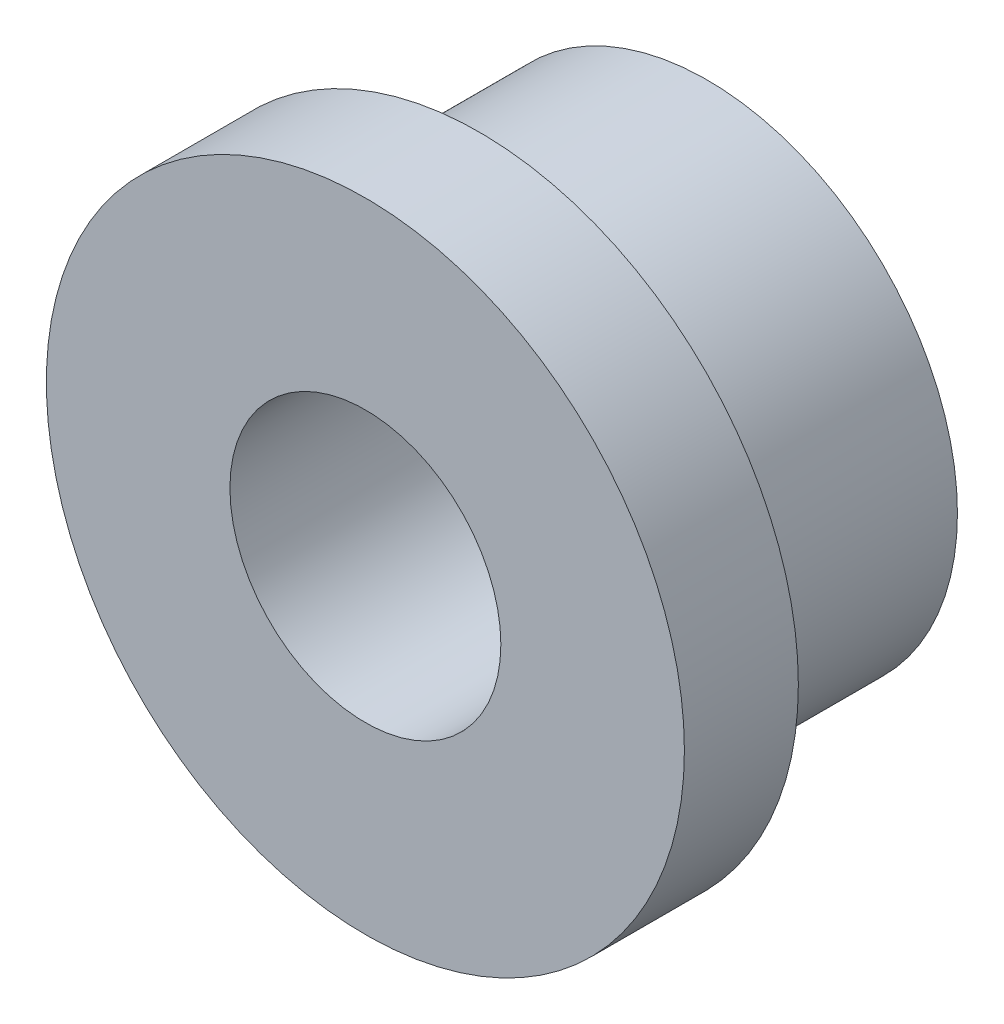
ISO-10303-21;
HEADER;
FILE_DESCRIPTION(('STEP AP214'),'2;1');
FILE_NAME('part.step','',(''),(''),'','','');
FILE_SCHEMA(('AUTOMOTIVE_DESIGN { 1 0 10303 214 1 1 1 1 }'));
ENDSEC;
DATA;
#1=APPLICATION_CONTEXT('core data for automotive mechanical design processes');
#2=APPLICATION_PROTOCOL_DEFINITION('international standard','automotive_design',2000,#1);
#3=PRODUCT_CONTEXT('',#1,'mechanical');
#4=PRODUCT('Part','Part','',(#3));
#5=PRODUCT_RELATED_PRODUCT_CATEGORY('part','',(#4));
#6=PRODUCT_DEFINITION_FORMATION('','',#4);
#7=PRODUCT_DEFINITION_CONTEXT('part definition',#1,'design');
#8=PRODUCT_DEFINITION('design','',#6,#7);
#9=PRODUCT_DEFINITION_SHAPE('','',#8);
#10=(LENGTH_UNIT() NAMED_UNIT(*) SI_UNIT(.MILLI.,.METRE.));
#11=(NAMED_UNIT(*) PLANE_ANGLE_UNIT() SI_UNIT($,.RADIAN.));
#12=(NAMED_UNIT(*) SI_UNIT($,.STERADIAN.) SOLID_ANGLE_UNIT());
#13=UNCERTAINTY_MEASURE_WITH_UNIT(LENGTH_MEASURE(1.E-05),#10,'distance_accuracy_value','');
#14=(GEOMETRIC_REPRESENTATION_CONTEXT(3) GLOBAL_UNCERTAINTY_ASSIGNED_CONTEXT((#13)) GLOBAL_UNIT_ASSIGNED_CONTEXT((#10,
#11,#12)) REPRESENTATION_CONTEXT('',''));
#15=CARTESIAN_POINT('',(0.,0.,0.));
#16=DIRECTION('',(0.,0.,1.));
#17=DIRECTION('',(1.,0.,0.));
#18=AXIS2_PLACEMENT_3D('',#15,#16,#17);
#19=CARTESIAN_POINT('',(0.,0.,0.));
#20=DIRECTION('',(0.,0.,-1.));
#21=DIRECTION('',(-1.,0.,0.));
#22=AXIS2_PLACEMENT_3D('',#19,#20,#21);
#23=PLANE('',#22);
#24=CARTESIAN_POINT('',(0.,0.,0.));
#25=DIRECTION('',(0.,0.,1.));
#26=DIRECTION('',(1.,0.,0.));
#27=AXIS2_PLACEMENT_3D('',#24,#25,#26);
#28=CIRCLE('',#27,11.89);
#29=CARTESIAN_POINT('',(11.89,0.,0.));
#30=VERTEX_POINT('',#29);
#31=EDGE_CURVE('E59',#30,#30,#28,.T.);
#32=ORIENTED_EDGE('',*,*,#31,.F.);
#33=EDGE_LOOP('',(#32));
#34=FACE_BOUND('',#33,.T.);
#35=CARTESIAN_POINT('',(0.,0.,0.));
#36=DIRECTION('',(0.,0.,1.));
#37=DIRECTION('',(1.,0.,0.));
#38=AXIS2_PLACEMENT_3D('',#35,#36,#37);
#39=CIRCLE('',#38,28.);
#40=CARTESIAN_POINT('',(28.,0.,0.));
#41=VERTEX_POINT('',#40);
#42=EDGE_CURVE('E10',#41,#41,#39,.T.);
#43=ORIENTED_EDGE('',*,*,#42,.T.);
#44=EDGE_LOOP('',(#43));
#45=FACE_BOUND('',#44,.T.);
#46=ADVANCED_FACE('F37',(#34,#45),#23,.F.);
#47=CARTESIAN_POINT('',(0.,0.,8.75770488448039));
#48=DIRECTION('',(0.,0.,1.));
#49=DIRECTION('',(1.,0.,0.));
#50=AXIS2_PLACEMENT_3D('',#47,#48,#49);
#51=CYLINDRICAL_SURFACE('',#50,28.);
#52=ORIENTED_EDGE('',*,*,#42,.F.);
#53=EDGE_LOOP('',(#52));
#54=FACE_BOUND('',#53,.T.);
#55=CARTESIAN_POINT('',(0.,0.,-10.));
#56=DIRECTION('',(0.,0.,1.));
#57=DIRECTION('',(1.,0.,0.));
#58=AXIS2_PLACEMENT_3D('',#55,#56,#57);
#59=CIRCLE('',#58,28.);
#60=CARTESIAN_POINT('',(28.,0.,-10.));
#61=VERTEX_POINT('',#60);
#62=EDGE_CURVE('E43',#61,#61,#59,.T.);
#63=ORIENTED_EDGE('',*,*,#62,.T.);
#64=EDGE_LOOP('',(#63));
#65=FACE_BOUND('',#64,.T.);
#66=ADVANCED_FACE('F76',(#54,#65),#51,.T.);
#67=CARTESIAN_POINT('',(0.,28.,-10.));
#68=DIRECTION('',(0.,0.,1.));
#69=DIRECTION('',(1.,0.,0.));
#70=AXIS2_PLACEMENT_3D('',#67,#68,#69);
#71=PLANE('',#70);
#72=ORIENTED_EDGE('',*,*,#62,.F.);
#73=EDGE_LOOP('',(#72));
#74=FACE_BOUND('',#73,.T.);
#75=CARTESIAN_POINT('',(0.,0.,-10.));
#76=DIRECTION('',(0.,0.,1.));
#77=DIRECTION('',(1.,0.,0.));
#78=AXIS2_PLACEMENT_3D('',#75,#76,#77);
#79=CIRCLE('',#78,21.963);
#80=CARTESIAN_POINT('',(21.963,0.,-10.));
#81=VERTEX_POINT('',#80);
#82=EDGE_CURVE('E47',#81,#81,#79,.T.);
#83=ORIENTED_EDGE('',*,*,#82,.T.);
#84=EDGE_LOOP('',(#83));
#85=FACE_BOUND('',#84,.T.);
#86=ADVANCED_FACE('F81',(#74,#85),#71,.F.);
#87=CARTESIAN_POINT('',(0.,0.,8.75770488448039));
#88=DIRECTION('',(0.,0.,1.));
#89=DIRECTION('',(1.,0.,0.));
#90=AXIS2_PLACEMENT_3D('',#87,#88,#89);
#91=CYLINDRICAL_SURFACE('',#90,21.963);
#92=ORIENTED_EDGE('',*,*,#82,.F.);
#93=EDGE_LOOP('',(#92));
#94=FACE_BOUND('',#93,.T.);
#95=CARTESIAN_POINT('',(0.,0.,-30.));
#96=DIRECTION('',(0.,0.,1.));
#97=DIRECTION('',(1.,0.,0.));
#98=AXIS2_PLACEMENT_3D('',#95,#96,#97);
#99=CIRCLE('',#98,21.963);
#100=CARTESIAN_POINT('',(21.963,0.,-30.));
#101=VERTEX_POINT('',#100);
#102=EDGE_CURVE('E51',#101,#101,#99,.T.);
#103=ORIENTED_EDGE('',*,*,#102,.T.);
#104=EDGE_LOOP('',(#103));
#105=FACE_BOUND('',#104,.T.);
#106=ADVANCED_FACE('F86',(#94,#105),#91,.T.);
#107=CARTESIAN_POINT('',(0.,0.,-40.));
#108=DIRECTION('',(0.,0.,1.));
#109=DIRECTION('',(1.,0.,0.));
#110=AXIS2_PLACEMENT_3D('',#107,#108,#109);
#111=CONICAL_SURFACE('',#110,7.5,0.965852341488585);
#112=ORIENTED_EDGE('',*,*,#102,.F.);
#113=EDGE_LOOP('',(#112));
#114=FACE_BOUND('',#113,.T.);
#115=CARTESIAN_POINT('',(0.,0.,-40.));
#116=DIRECTION('',(0.,0.,1.));
#117=DIRECTION('',(1.,0.,0.));
#118=AXIS2_PLACEMENT_3D('',#115,#116,#117);
#119=CIRCLE('',#118,7.5);
#120=CARTESIAN_POINT('',(7.5,0.,-40.));
#121=VERTEX_POINT('',#120);
#122=EDGE_CURVE('E56',#121,#121,#119,.T.);
#123=ORIENTED_EDGE('',*,*,#122,.T.);
#124=EDGE_LOOP('',(#123));
#125=FACE_BOUND('',#124,.T.);
#126=ADVANCED_FACE('F92',(#114,#125),#111,.T.);
#127=CARTESIAN_POINT('',(0.,7.5,-40.));
#128=DIRECTION('',(0.,0.,1.));
#129=DIRECTION('',(1.,0.,0.));
#130=AXIS2_PLACEMENT_3D('',#127,#128,#129);
#131=PLANE('',#130);
#132=ORIENTED_EDGE('',*,*,#122,.F.);
#133=EDGE_LOOP('',(#132));
#134=FACE_BOUND('',#133,.T.);
#135=ADVANCED_FACE('F71',(#134),#131,.F.);
#136=CARTESIAN_POINT('',(0.,0.,0.));
#137=DIRECTION('',(0.,0.,1.));
#138=DIRECTION('',(1.,0.,0.));
#139=AXIS2_PLACEMENT_3D('',#136,#137,#138);
#140=CYLINDRICAL_SURFACE('',#139,11.89);
#141=CARTESIAN_POINT('',(0.,0.,-20.));
#142=DIRECTION('',(0.,0.,1.));
#143=DIRECTION('',(1.,0.,0.));
#144=AXIS2_PLACEMENT_3D('',#141,#142,#143);
#145=CIRCLE('',#144,11.89);
#146=CARTESIAN_POINT('',(11.89,0.,-20.));
#147=VERTEX_POINT('',#146);
#148=EDGE_CURVE('E62',#147,#147,#145,.T.);
#149=ORIENTED_EDGE('',*,*,#148,.F.);
#150=EDGE_LOOP('',(#149));
#151=FACE_BOUND('',#150,.T.);
#152=ORIENTED_EDGE('',*,*,#31,.T.);
#153=EDGE_LOOP('',(#152));
#154=FACE_BOUND('',#153,.T.);
#155=ADVANCED_FACE('F68',(#151,#154),#140,.F.);
#156=CARTESIAN_POINT('',(11.89,0.,-20.));
#157=DIRECTION('',(0.,0.,-1.));
#158=DIRECTION('',(-1.,0.,0.));
#159=AXIS2_PLACEMENT_3D('',#156,#157,#158);
#160=PLANE('',#159);
#161=ORIENTED_EDGE('',*,*,#148,.T.);
#162=EDGE_LOOP('',(#161));
#163=FACE_BOUND('',#162,.T.);
#164=ADVANCED_FACE('F66',(#163),#160,.F.);
#165=CLOSED_SHELL('',(#46,#66,#86,#106,#126,#135,#155,#164));
#166=MANIFOLD_SOLID_BREP('B2',#165);
#167=ADVANCED_BREP_SHAPE_REPRESENTATION('',(#18,#166),#14);
#168=SHAPE_DEFINITION_REPRESENTATION(#9,#167);
ENDSEC;
END-ISO-10303-21;
